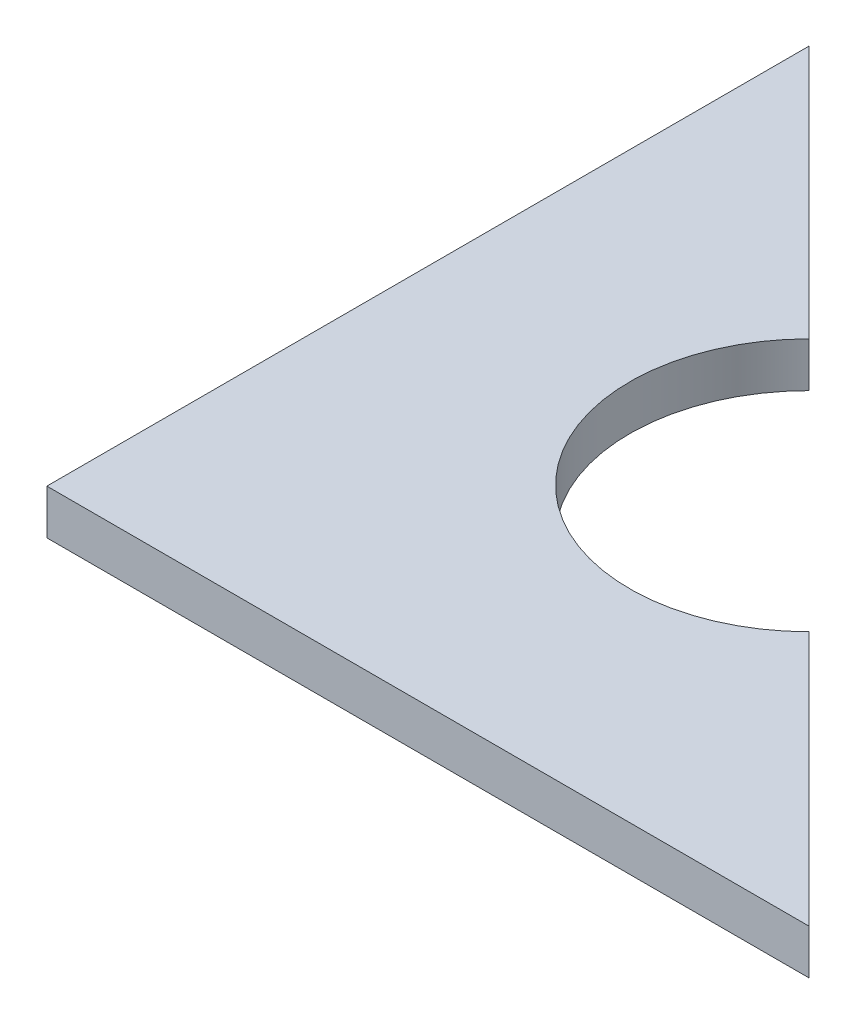
ISO-10303-21;
HEADER;
FILE_DESCRIPTION(('STEP AP214'),'2;1');
FILE_NAME('part.step','',(''),(''),'','','');
FILE_SCHEMA(('AUTOMOTIVE_DESIGN { 1 0 10303 214 1 1 1 1 }'));
ENDSEC;
DATA;
#1=APPLICATION_CONTEXT('core data for automotive mechanical design processes');
#2=APPLICATION_PROTOCOL_DEFINITION('international standard','automotive_design',2000,#1);
#3=PRODUCT_CONTEXT('',#1,'mechanical');
#4=PRODUCT('Part','Part','',(#3));
#5=PRODUCT_RELATED_PRODUCT_CATEGORY('part','',(#4));
#6=PRODUCT_DEFINITION_FORMATION('','',#4);
#7=PRODUCT_DEFINITION_CONTEXT('part definition',#1,'design');
#8=PRODUCT_DEFINITION('design','',#6,#7);
#9=PRODUCT_DEFINITION_SHAPE('','',#8);
#10=(LENGTH_UNIT() NAMED_UNIT(*) SI_UNIT(.MILLI.,.METRE.));
#11=(NAMED_UNIT(*) PLANE_ANGLE_UNIT() SI_UNIT($,.RADIAN.));
#12=(NAMED_UNIT(*) SI_UNIT($,.STERADIAN.) SOLID_ANGLE_UNIT());
#13=UNCERTAINTY_MEASURE_WITH_UNIT(LENGTH_MEASURE(1.E-05),#10,'distance_accuracy_value','');
#14=(GEOMETRIC_REPRESENTATION_CONTEXT(3) GLOBAL_UNCERTAINTY_ASSIGNED_CONTEXT((#13)) GLOBAL_UNIT_ASSIGNED_CONTEXT((#10,
#11,#12)) REPRESENTATION_CONTEXT('',''));
#15=CARTESIAN_POINT('',(0.,0.,0.));
#16=DIRECTION('',(0.,0.,1.));
#17=DIRECTION('',(1.,0.,0.));
#18=AXIS2_PLACEMENT_3D('',#15,#16,#17);
#19=CARTESIAN_POINT('',(0.,4.99999999999995,0.));
#20=DIRECTION('',(0.707106781186548,0.,-0.707106781186548));
#21=DIRECTION('',(-0.707106781186548,0.,-0.707106781186548));
#22=AXIS2_PLACEMENT_3D('',#19,#20,#21);
#23=PLANE('',#22);
#24=DIRECTION('',(0.707106781186548,0.,0.707106781186548));
#25=VECTOR('',#24,1.);
#26=CARTESIAN_POINT('',(0.,0.,0.));
#27=LINE('',#26,#25);
#28=CARTESIAN_POINT('',(14.063953431281,0.,14.0639534312814));
#29=VERTEX_POINT('',#28);
#30=CARTESIAN_POINT('',(42.5000000000004,0.,42.5000000000006));
#31=VERTEX_POINT('',#30);
#32=EDGE_CURVE('E104',#29,#31,#27,.T.);
#33=ORIENTED_EDGE('',*,*,#32,.F.);
#34=DIRECTION('',(0.,-1.,0.));
#35=VECTOR('',#34,1.);
#36=CARTESIAN_POINT('',(14.0639534312812,4.99999999999995,14.0639534312816));
#37=LINE('',#36,#35);
#38=CARTESIAN_POINT('',(14.0639534312812,4.99999999999995,14.0639534312816));
#39=VERTEX_POINT('',#38);
#40=EDGE_CURVE('E11',#39,#29,#37,.T.);
#41=ORIENTED_EDGE('',*,*,#40,.F.);
#42=DIRECTION('',(0.707106781186548,0.,0.707106781186548));
#43=VECTOR('',#42,1.);
#44=CARTESIAN_POINT('',(0.,4.99999999999995,0.));
#45=LINE('',#44,#43);
#46=CARTESIAN_POINT('',(42.5000000000004,4.99999999999995,42.5000000000002));
#47=VERTEX_POINT('',#46);
#48=EDGE_CURVE('E114',#39,#47,#45,.T.);
#49=ORIENTED_EDGE('',*,*,#48,.T.);
#50=DIRECTION('',(0.,-1.,0.));
#51=VECTOR('',#50,1.);
#52=CARTESIAN_POINT('',(42.5000000000004,4.99999999999995,42.5000000000002));
#53=LINE('',#52,#51);
#54=EDGE_CURVE('E46',#47,#31,#53,.T.);
#55=ORIENTED_EDGE('',*,*,#54,.T.);
#56=EDGE_LOOP('',(#33,#41,#49,#55));
#57=FACE_BOUND('',#56,.T.);
#58=ADVANCED_FACE('F30',(#57),#23,.T.);
#59=CARTESIAN_POINT('',(-0.0781821924498161,4.99999999999995,-0.0781821924500381));
#60=DIRECTION('',(0.,-1.,0.));
#61=DIRECTION('',(0.,0.,-1.));
#62=AXIS2_PLACEMENT_3D('',#59,#60,#61);
#63=CYLINDRICAL_SURFACE('',#62,20.);
#64=CARTESIAN_POINT('',(-0.0781821924500381,0.,-0.0781821924500381));
#65=DIRECTION('',(0.,1.,0.));
#66=DIRECTION('',(0.,0.,1.));
#67=AXIS2_PLACEMENT_3D('',#64,#65,#66);
#68=CIRCLE('',#67,20.);
#69=CARTESIAN_POINT('',(-14.2203178161806,0.,-14.2203178161808));
#70=VERTEX_POINT('',#69);
#71=EDGE_CURVE('E106',#29,#70,#68,.F.);
#72=ORIENTED_EDGE('',*,*,#71,.T.);
#73=DIRECTION('',(0.,-1.,0.));
#74=VECTOR('',#73,1.);
#75=CARTESIAN_POINT('',(-14.2203178161806,4.99999999999984,-14.2203178161808));
#76=LINE('',#75,#74);
#77=CARTESIAN_POINT('',(-14.2203178161806,4.99999999999984,-14.2203178161808));
#78=VERTEX_POINT('',#77);
#79=EDGE_CURVE('E38',#78,#70,#76,.T.);
#80=ORIENTED_EDGE('',*,*,#79,.F.);
#81=CARTESIAN_POINT('',(-0.0781821924498161,4.99999999999995,-0.0781821924500381));
#82=DIRECTION('',(0.,1.,0.));
#83=DIRECTION('',(0.,0.,1.));
#84=AXIS2_PLACEMENT_3D('',#81,#82,#83);
#85=CIRCLE('',#84,20.);
#86=EDGE_CURVE('E85',#39,#78,#85,.F.);
#87=ORIENTED_EDGE('',*,*,#86,.F.);
#88=ORIENTED_EDGE('',*,*,#40,.T.);
#89=EDGE_LOOP('',(#72,#80,#87,#88));
#90=FACE_BOUND('',#89,.T.);
#91=ADVANCED_FACE('F131',(#90),#63,.F.);
#92=CARTESIAN_POINT('',(0.,4.99999999999995,0.));
#93=DIRECTION('',(-0.707106781186547,0.,0.707106781186548));
#94=DIRECTION('',(0.707106781186548,0.,0.707106781186547));
#95=AXIS2_PLACEMENT_3D('',#92,#93,#94);
#96=PLANE('',#95);
#97=DIRECTION('',(-0.707106781186548,0.,-0.707106781186547));
#98=VECTOR('',#97,1.);
#99=CARTESIAN_POINT('',(0.,0.,0.));
#100=LINE('',#99,#98);
#101=CARTESIAN_POINT('',(-42.4999999999998,-1.38777878078145E-13,-42.4999999999978));
#102=VERTEX_POINT('',#101);
#103=EDGE_CURVE('E94',#70,#102,#100,.T.);
#104=ORIENTED_EDGE('',*,*,#103,.T.);
#105=DIRECTION('',(0.,-1.,0.));
#106=VECTOR('',#105,1.);
#107=CARTESIAN_POINT('',(-42.4999999999998,5.,-42.499999999998));
#108=LINE('',#107,#106);
#109=CARTESIAN_POINT('',(-42.4999999999998,5.,-42.499999999998));
#110=VERTEX_POINT('',#109);
#111=EDGE_CURVE('E91',#110,#102,#108,.T.);
#112=ORIENTED_EDGE('',*,*,#111,.F.);
#113=DIRECTION('',(-0.707106781186548,0.,-0.707106781186547));
#114=VECTOR('',#113,1.);
#115=CARTESIAN_POINT('',(0.,4.99999999999995,0.));
#116=LINE('',#115,#114);
#117=EDGE_CURVE('E78',#78,#110,#116,.T.);
#118=ORIENTED_EDGE('',*,*,#117,.F.);
#119=ORIENTED_EDGE('',*,*,#79,.T.);
#120=EDGE_LOOP('',(#104,#112,#118,#119));
#121=FACE_BOUND('',#120,.T.);
#122=ADVANCED_FACE('F92',(#121),#96,.F.);
#123=CARTESIAN_POINT('',(-42.4999999999998,4.99999999999995,1.77635683940025E-12));
#124=DIRECTION('',(-1.,0.,0.));
#125=DIRECTION('',(0.,0.,1.));
#126=AXIS2_PLACEMENT_3D('',#123,#124,#125);
#127=PLANE('',#126);
#128=DIRECTION('',(0.,0.,-1.));
#129=VECTOR('',#128,1.);
#130=CARTESIAN_POINT('',(-42.5,0.,1.99840144432528E-12));
#131=LINE('',#130,#129);
#132=CARTESIAN_POINT('',(-42.5000000000002,-1.11022302462516E-13,42.5000000000013));
#133=VERTEX_POINT('',#132);
#134=EDGE_CURVE('E109',#133,#102,#131,.T.);
#135=ORIENTED_EDGE('',*,*,#134,.F.);
#136=DIRECTION('',(0.,-1.,0.));
#137=VECTOR('',#136,1.);
#138=CARTESIAN_POINT('',(-42.4999999999998,4.99999999999995,42.5000000000011));
#139=LINE('',#138,#137);
#140=CARTESIAN_POINT('',(-42.4999999999998,4.99999999999995,42.5000000000011));
#141=VERTEX_POINT('',#140);
#142=EDGE_CURVE('E62',#141,#133,#139,.T.);
#143=ORIENTED_EDGE('',*,*,#142,.F.);
#144=DIRECTION('',(0.,0.,-1.));
#145=VECTOR('',#144,1.);
#146=CARTESIAN_POINT('',(-42.4999999999998,4.99999999999995,1.77635683940025E-12));
#147=LINE('',#146,#145);
#148=EDGE_CURVE('E84',#141,#110,#147,.T.);
#149=ORIENTED_EDGE('',*,*,#148,.T.);
#150=ORIENTED_EDGE('',*,*,#111,.T.);
#151=EDGE_LOOP('',(#135,#143,#149,#150));
#152=FACE_BOUND('',#151,.T.);
#153=ADVANCED_FACE('F98',(#152),#127,.T.);
#154=CARTESIAN_POINT('',(0.,4.99999999999987,42.5000000000002));
#155=DIRECTION('',(0.,0.,1.));
#156=DIRECTION('',(1.,0.,0.));
#157=AXIS2_PLACEMENT_3D('',#154,#155,#156);
#158=PLANE('',#157);
#159=DIRECTION('',(-1.,0.,0.));
#160=VECTOR('',#159,1.);
#161=CARTESIAN_POINT('',(-2.22044604925031E-13,0.,42.5000000000002));
#162=LINE('',#161,#160);
#163=EDGE_CURVE('E111',#31,#133,#162,.T.);
#164=ORIENTED_EDGE('',*,*,#163,.F.);
#165=ORIENTED_EDGE('',*,*,#54,.F.);
#166=DIRECTION('',(-1.,0.,0.));
#167=VECTOR('',#166,1.);
#168=CARTESIAN_POINT('',(0.,4.99999999999987,42.5000000000002));
#169=LINE('',#168,#167);
#170=EDGE_CURVE('E99',#47,#141,#169,.T.);
#171=ORIENTED_EDGE('',*,*,#170,.T.);
#172=ORIENTED_EDGE('',*,*,#142,.T.);
#173=EDGE_LOOP('',(#164,#165,#171,#172));
#174=FACE_BOUND('',#173,.T.);
#175=ADVANCED_FACE('F120',(#174),#158,.T.);
#176=CARTESIAN_POINT('',(0.,4.99999999999995,0.));
#177=DIRECTION('',(0.,1.,0.));
#178=DIRECTION('',(0.,0.,1.));
#179=AXIS2_PLACEMENT_3D('',#176,#177,#178);
#180=PLANE('',#179);
#181=ORIENTED_EDGE('',*,*,#48,.F.);
#182=ORIENTED_EDGE('',*,*,#86,.T.);
#183=ORIENTED_EDGE('',*,*,#117,.T.);
#184=ORIENTED_EDGE('',*,*,#148,.F.);
#185=ORIENTED_EDGE('',*,*,#170,.F.);
#186=EDGE_LOOP('',(#181,#182,#183,#184,#185));
#187=FACE_BOUND('',#186,.T.);
#188=ADVANCED_FACE('F81',(#187),#180,.T.);
#189=CARTESIAN_POINT('',(0.,0.,0.));
#190=DIRECTION('',(0.,1.,0.));
#191=DIRECTION('',(0.,0.,1.));
#192=AXIS2_PLACEMENT_3D('',#189,#190,#191);
#193=PLANE('',#192);
#194=ORIENTED_EDGE('',*,*,#32,.T.);
#195=ORIENTED_EDGE('',*,*,#163,.T.);
#196=ORIENTED_EDGE('',*,*,#134,.T.);
#197=ORIENTED_EDGE('',*,*,#103,.F.);
#198=ORIENTED_EDGE('',*,*,#71,.F.);
#199=EDGE_LOOP('',(#194,#195,#196,#197,#198));
#200=FACE_BOUND('',#199,.T.);
#201=ADVANCED_FACE('F119',(#200),#193,.F.);
#202=CLOSED_SHELL('',(#58,#91,#122,#153,#175,#188,#201));
#203=MANIFOLD_SOLID_BREP('B2',#202);
#204=ADVANCED_BREP_SHAPE_REPRESENTATION('',(#18,#203),#14);
#205=SHAPE_DEFINITION_REPRESENTATION(#9,#204);
ENDSEC;
END-ISO-10303-21;
